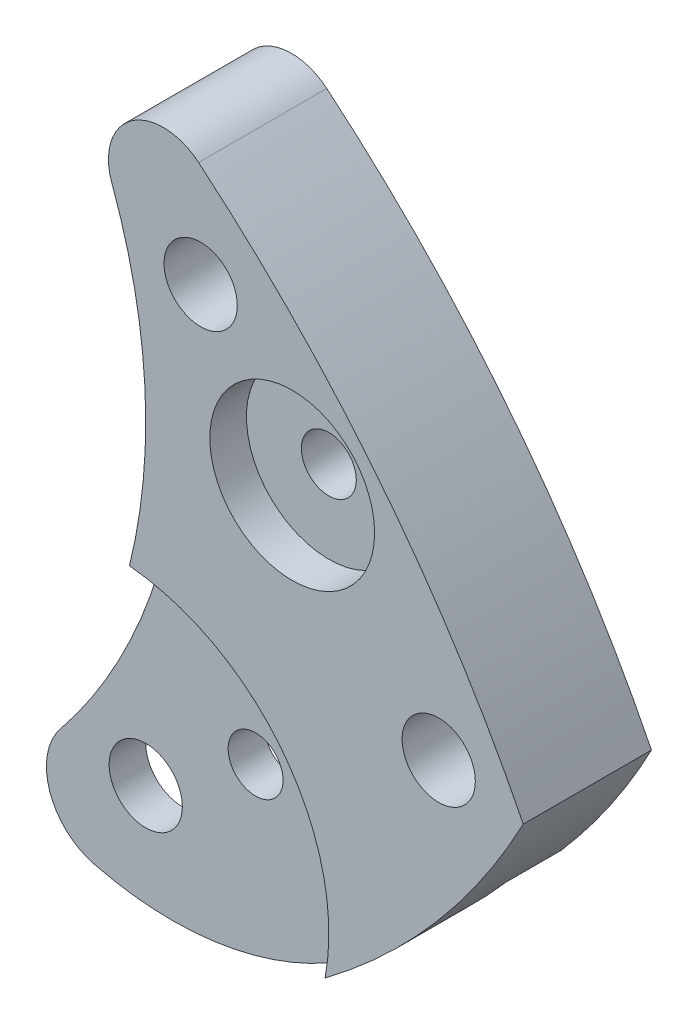
ISO-10303-21;
HEADER;
FILE_DESCRIPTION(('STEP AP214'),'2;1');
FILE_NAME('part.step','',(''),(''),'','','');
FILE_SCHEMA(('AUTOMOTIVE_DESIGN { 1 0 10303 214 1 1 1 1 }'));
ENDSEC;
DATA;
#1=APPLICATION_CONTEXT('core data for automotive mechanical design processes');
#2=APPLICATION_PROTOCOL_DEFINITION('international standard','automotive_design',2000,#1);
#3=PRODUCT_CONTEXT('',#1,'mechanical');
#4=PRODUCT('Part','Part','',(#3));
#5=PRODUCT_RELATED_PRODUCT_CATEGORY('part','',(#4));
#6=PRODUCT_DEFINITION_FORMATION('','',#4);
#7=PRODUCT_DEFINITION_CONTEXT('part definition',#1,'design');
#8=PRODUCT_DEFINITION('design','',#6,#7);
#9=PRODUCT_DEFINITION_SHAPE('','',#8);
#10=(LENGTH_UNIT() NAMED_UNIT(*) SI_UNIT(.MILLI.,.METRE.));
#11=(NAMED_UNIT(*) PLANE_ANGLE_UNIT() SI_UNIT($,.RADIAN.));
#12=(NAMED_UNIT(*) SI_UNIT($,.STERADIAN.) SOLID_ANGLE_UNIT());
#13=UNCERTAINTY_MEASURE_WITH_UNIT(LENGTH_MEASURE(1.E-05),#10,'distance_accuracy_value','');
#14=(GEOMETRIC_REPRESENTATION_CONTEXT(3) GLOBAL_UNCERTAINTY_ASSIGNED_CONTEXT((#13)) GLOBAL_UNIT_ASSIGNED_CONTEXT((#10,
#11,#12)) REPRESENTATION_CONTEXT('',''));
#15=CARTESIAN_POINT('',(0.,0.,0.));
#16=DIRECTION('',(0.,0.,1.));
#17=DIRECTION('',(1.,0.,0.));
#18=AXIS2_PLACEMENT_3D('',#15,#16,#17);
#19=CARTESIAN_POINT('',(9.5,4.75,1.75));
#20=DIRECTION('',(0.,0.,-1.));
#21=DIRECTION('',(-1.,0.,0.));
#22=AXIS2_PLACEMENT_3D('',#19,#20,#21);
#23=CYLINDRICAL_SURFACE('',#22,0.855387483534203);
#24=CARTESIAN_POINT('',(9.5,4.75,1.25));
#25=DIRECTION('',(0.,0.,1.));
#26=DIRECTION('',(1.,0.,0.));
#27=AXIS2_PLACEMENT_3D('',#24,#25,#26);
#28=CIRCLE('',#27,0.855387483534203);
#29=CARTESIAN_POINT('',(8.83455885152791,5.28747169684284,1.25));
#30=VERTEX_POINT('',#29);
#31=CARTESIAN_POINT('',(9.28763002381973,3.92139470180057,1.25));
#32=VERTEX_POINT('',#31);
#33=EDGE_CURVE('E267',#30,#32,#28,.T.);
#34=ORIENTED_EDGE('',*,*,#33,.F.);
#35=DIRECTION('',(0.,0.,-1.));
#36=VECTOR('',#35,1.);
#37=CARTESIAN_POINT('',(8.83455885152791,5.28747169684284,1.75));
#38=LINE('',#37,#36);
#39=CARTESIAN_POINT('',(8.83455885152791,5.28747169684284,0.75));
#40=VERTEX_POINT('',#39);
#41=EDGE_CURVE('E168',#30,#40,#38,.T.);
#42=ORIENTED_EDGE('',*,*,#41,.T.);
#43=CARTESIAN_POINT('',(9.5,4.75,0.75));
#44=DIRECTION('',(0.,0.,-1.));
#45=DIRECTION('',(-1.,0.,0.));
#46=AXIS2_PLACEMENT_3D('',#43,#44,#45);
#47=CIRCLE('',#46,0.855387483534203);
#48=CARTESIAN_POINT('',(9.28763002381973,3.92139470180057,0.75));
#49=VERTEX_POINT('',#48);
#50=EDGE_CURVE('E191',#49,#40,#47,.T.);
#51=ORIENTED_EDGE('',*,*,#50,.F.);
#52=DIRECTION('',(0.,0.,-1.));
#53=VECTOR('',#52,1.);
#54=CARTESIAN_POINT('',(9.28763002381973,3.92139470180057,1.75));
#55=LINE('',#54,#53);
#56=EDGE_CURVE('E166',#32,#49,#55,.T.);
#57=ORIENTED_EDGE('',*,*,#56,.F.);
#58=EDGE_LOOP('',(#34,#42,#51,#57));
#59=FACE_BOUND('',#58,.T.);
#60=ADVANCED_FACE('F38',(#59),#23,.T.);
#61=CARTESIAN_POINT('',(10.3593783598883,8.10304205881201,1.75));
#62=DIRECTION('',(0.,0.,-1.));
#63=DIRECTION('',(-1.,0.,0.));
#64=AXIS2_PLACEMENT_3D('',#61,#62,#63);
#65=CYLINDRICAL_SURFACE('',#64,4.31680658754437);
#66=CARTESIAN_POINT('',(10.3593783598883,8.10304205881201,1.25));
#67=DIRECTION('',(0.,0.,1.));
#68=DIRECTION('',(1.,0.,0.));
#69=AXIS2_PLACEMENT_3D('',#66,#67,#68);
#70=CIRCLE('',#69,4.31680658754437);
#71=CARTESIAN_POINT('',(12.9490145009742,4.64926097555729,1.25));
#72=VERTEX_POINT('',#71);
#73=EDGE_CURVE('E266',#32,#72,#70,.T.);
#74=ORIENTED_EDGE('',*,*,#73,.F.);
#75=ORIENTED_EDGE('',*,*,#56,.T.);
#76=CARTESIAN_POINT('',(10.3593783598883,8.10304205881201,0.75));
#77=DIRECTION('',(0.,0.,-1.));
#78=DIRECTION('',(-1.,0.,0.));
#79=AXIS2_PLACEMENT_3D('',#76,#77,#78);
#80=CIRCLE('',#79,4.31680658754437);
#81=CARTESIAN_POINT('',(12.9490145009742,4.64926097555729,0.75));
#82=VERTEX_POINT('',#81);
#83=EDGE_CURVE('E177',#82,#49,#80,.T.);
#84=ORIENTED_EDGE('',*,*,#83,.F.);
#85=DIRECTION('',(0.,0.,-1.));
#86=VECTOR('',#85,1.);
#87=CARTESIAN_POINT('',(12.9490145009742,4.64926097555729,1.75));
#88=LINE('',#87,#86);
#89=EDGE_CURVE('E164',#72,#82,#88,.T.);
#90=ORIENTED_EDGE('',*,*,#89,.F.);
#91=EDGE_LOOP('',(#74,#75,#84,#90));
#92=FACE_BOUND('',#91,.T.);
#93=ADVANCED_FACE('F228',(#92),#65,.T.);
#94=CARTESIAN_POINT('',(10.,5.2,1.75));
#95=DIRECTION('',(0.,0.,-1.));
#96=DIRECTION('',(-1.,0.,0.));
#97=AXIS2_PLACEMENT_3D('',#94,#95,#96);
#98=CYLINDRICAL_SURFACE('',#97,0.500000000000001);
#99=CARTESIAN_POINT('',(10.,5.2,0.75));
#100=DIRECTION('',(0.,0.,-1.));
#101=DIRECTION('',(-1.,0.,0.));
#102=AXIS2_PLACEMENT_3D('',#99,#100,#101);
#103=CIRCLE('',#102,0.500000000000001);
#104=CARTESIAN_POINT('',(9.5,5.2,0.75));
#105=VERTEX_POINT('',#104);
#106=EDGE_CURVE('E170',#105,#105,#103,.T.);
#107=ORIENTED_EDGE('',*,*,#106,.T.);
#108=EDGE_LOOP('',(#107));
#109=FACE_BOUND('',#108,.T.);
#110=CARTESIAN_POINT('',(10.,5.2,1.25));
#111=DIRECTION('',(0.,0.,1.));
#112=DIRECTION('',(1.,0.,0.));
#113=AXIS2_PLACEMENT_3D('',#110,#111,#112);
#114=CIRCLE('',#113,0.500000000000001);
#115=CARTESIAN_POINT('',(10.5,5.2,1.25));
#116=VERTEX_POINT('',#115);
#117=EDGE_CURVE('E334',#116,#116,#114,.T.);
#118=ORIENTED_EDGE('',*,*,#117,.T.);
#119=EDGE_LOOP('',(#118));
#120=FACE_BOUND('',#119,.T.);
#121=ADVANCED_FACE('F234',(#109,#120),#98,.F.);
#122=CARTESIAN_POINT('',(3.,10.,1.75));
#123=DIRECTION('',(0.,0.,-1.));
#124=DIRECTION('',(-1.,0.,0.));
#125=AXIS2_PLACEMENT_3D('',#122,#123,#124);
#126=CYLINDRICAL_SURFACE('',#125,7.5);
#127=CARTESIAN_POINT('',(3.,10.,1.25));
#128=DIRECTION('',(0.,0.,1.));
#129=DIRECTION('',(1.,0.,0.));
#130=AXIS2_PLACEMENT_3D('',#127,#128,#129);
#131=CIRCLE('',#130,7.5);
#132=CARTESIAN_POINT('',(10.2776024250335,8.18712853650718,1.25));
#133=VERTEX_POINT('',#132);
#134=EDGE_CURVE('E134',#133,#30,#131,.F.);
#135=ORIENTED_EDGE('',*,*,#134,.F.);
#136=DIRECTION('',(0.,0.,1.));
#137=VECTOR('',#136,1.);
#138=CARTESIAN_POINT('',(10.2776024250335,8.18712853650718,1.5));
#139=LINE('',#138,#137);
#140=CARTESIAN_POINT('',(10.2776024250335,8.18712853650718,1.75));
#141=VERTEX_POINT('',#140);
#142=EDGE_CURVE('E119',#133,#141,#139,.T.);
#143=ORIENTED_EDGE('',*,*,#142,.T.);
#144=CARTESIAN_POINT('',(3.,10.,1.75));
#145=DIRECTION('',(0.,0.,-1.));
#146=DIRECTION('',(1.,0.,0.));
#147=AXIS2_PLACEMENT_3D('',#144,#145,#146);
#148=CIRCLE('',#147,7.5);
#149=CARTESIAN_POINT('',(10.0373731864196,12.5933334986196,1.75));
#150=VERTEX_POINT('',#149);
#151=EDGE_CURVE('E131',#150,#141,#148,.T.);
#152=ORIENTED_EDGE('',*,*,#151,.F.);
#153=DIRECTION('',(0.,0.,-1.));
#154=VECTOR('',#153,1.);
#155=CARTESIAN_POINT('',(10.0373731864196,12.5933334986196,1.75));
#156=LINE('',#155,#154);
#157=CARTESIAN_POINT('',(10.0373731864196,12.5933334986196,0.75));
#158=VERTEX_POINT('',#157);
#159=EDGE_CURVE('E46',#150,#158,#156,.T.);
#160=ORIENTED_EDGE('',*,*,#159,.T.);
#161=CARTESIAN_POINT('',(3.,10.,0.75));
#162=DIRECTION('',(0.,0.,-1.));
#163=DIRECTION('',(-1.,0.,0.));
#164=AXIS2_PLACEMENT_3D('',#161,#162,#163);
#165=CIRCLE('',#164,7.5);
#166=EDGE_CURVE('E194',#40,#158,#165,.F.);
#167=ORIENTED_EDGE('',*,*,#166,.F.);
#168=ORIENTED_EDGE('',*,*,#41,.F.);
#169=EDGE_LOOP('',(#135,#143,#152,#160,#167,#168));
#170=FACE_BOUND('',#169,.T.);
#171=ADVANCED_FACE('F129',(#170),#126,.F.);
#172=CARTESIAN_POINT('',(5.37055525253078,6.42633342424077,1.75));
#173=DIRECTION('',(0.,0.,-1.));
#174=DIRECTION('',(-1.,0.,0.));
#175=AXIS2_PLACEMENT_3D('',#172,#173,#174);
#176=PLANE('',#175);
#177=CARTESIAN_POINT('',(12.5,10.25,1.75));
#178=DIRECTION('',(0.,0.,1.));
#179=DIRECTION('',(1.,0.,0.));
#180=AXIS2_PLACEMENT_3D('',#177,#178,#179);
#181=CIRCLE('',#180,1.125);
#182=CARTESIAN_POINT('',(13.625,10.25,1.75));
#183=VERTEX_POINT('',#182);
#184=EDGE_CURVE('E278',#183,#183,#181,.T.);
#185=ORIENTED_EDGE('',*,*,#184,.F.);
#186=EDGE_LOOP('',(#185));
#187=FACE_BOUND('',#186,.T.);
#188=CARTESIAN_POINT('',(11.25,12.,1.75));
#189=DIRECTION('',(0.,0.,1.));
#190=DIRECTION('',(1.,0.,0.));
#191=AXIS2_PLACEMENT_3D('',#188,#189,#190);
#192=CIRCLE('',#191,0.500000000000001);
#193=CARTESIAN_POINT('',(11.75,12.,1.75));
#194=VERTEX_POINT('',#193);
#195=EDGE_CURVE('E156',#194,#194,#192,.T.);
#196=ORIENTED_EDGE('',*,*,#195,.F.);
#197=EDGE_LOOP('',(#196));
#198=FACE_BOUND('',#197,.T.);
#199=ORIENTED_EDGE('',*,*,#151,.T.);
#200=CARTESIAN_POINT('',(10.,5.2,1.75));
#201=DIRECTION('',(0.,0.,1.));
#202=DIRECTION('',(1.,0.,0.));
#203=AXIS2_PLACEMENT_3D('',#200,#201,#202);
#204=CIRCLE('',#203,3.);
#205=CARTESIAN_POINT('',(12.9490145009742,4.64926097555729,1.75));
#206=VERTEX_POINT('',#205);
#207=EDGE_CURVE('E116',#206,#141,#204,.T.);
#208=ORIENTED_EDGE('',*,*,#207,.F.);
#209=CARTESIAN_POINT('',(7.25,12.25,1.75));
#210=DIRECTION('',(0.,0.,1.));
#211=DIRECTION('',(1.,0.,0.));
#212=AXIS2_PLACEMENT_3D('',#209,#210,#211);
#213=CIRCLE('',#212,9.5);
#214=CARTESIAN_POINT('',(15.6547566555464,7.82167463243173,1.75));
#215=VERTEX_POINT('',#214);
#216=EDGE_CURVE('E142',#206,#215,#213,.T.);
#217=ORIENTED_EDGE('',*,*,#216,.T.);
#218=CARTESIAN_POINT('',(0.,0.,1.75));
#219=DIRECTION('',(0.,0.,1.));
#220=DIRECTION('',(1.,0.,0.));
#221=AXIS2_PLACEMENT_3D('',#218,#219,#220);
#222=CIRCLE('',#221,17.5);
#223=CARTESIAN_POINT('',(11.2220557515568,13.4281593939359,1.75));
#224=VERTEX_POINT('',#223);
#225=EDGE_CURVE('E144',#215,#224,#222,.T.);
#226=ORIENTED_EDGE('',*,*,#225,.T.);
#227=CARTESIAN_POINT('',(10.7411105050616,12.8526668484815,1.75));
#228=DIRECTION('',(0.,0.,1.));
#229=DIRECTION('',(-1.,0.,0.));
#230=AXIS2_PLACEMENT_3D('',#227,#228,#229);
#231=CIRCLE('',#230,0.749999999999996);
#232=EDGE_CURVE('E140',#224,#150,#231,.T.);
#233=ORIENTED_EDGE('',*,*,#232,.T.);
#234=EDGE_LOOP('',(#199,#208,#217,#226,#233));
#235=FACE_BOUND('',#234,.T.);
#236=CARTESIAN_POINT('',(14.5,8.,1.75));
#237=DIRECTION('',(0.,0.,1.));
#238=DIRECTION('',(1.,0.,0.));
#239=AXIS2_PLACEMENT_3D('',#236,#237,#238);
#240=CIRCLE('',#239,0.500000000000001);
#241=CARTESIAN_POINT('',(15.,8.,1.75));
#242=VERTEX_POINT('',#241);
#243=EDGE_CURVE('E197',#242,#242,#240,.T.);
#244=ORIENTED_EDGE('',*,*,#243,.F.);
#245=EDGE_LOOP('',(#244));
#246=FACE_BOUND('',#245,.T.);
#247=ADVANCED_FACE('F137',(#187,#198,#235,#246),#176,.F.);
#248=CARTESIAN_POINT('',(5.37055525253078,6.42633342424077,0.));
#249=DIRECTION('',(0.,0.,-1.));
#250=DIRECTION('',(-1.,0.,0.));
#251=AXIS2_PLACEMENT_3D('',#248,#249,#250);
#252=PLANE('',#251);
#253=CARTESIAN_POINT('',(12.5,10.25,0.));
#254=DIRECTION('',(0.,0.,1.));
#255=DIRECTION('',(1.,0.,0.));
#256=AXIS2_PLACEMENT_3D('',#253,#254,#255);
#257=CIRCLE('',#256,0.375);
#258=CARTESIAN_POINT('',(12.875,10.25,0.));
#259=VERTEX_POINT('',#258);
#260=EDGE_CURVE('E343',#259,#259,#257,.T.);
#261=ORIENTED_EDGE('',*,*,#260,.T.);
#262=EDGE_LOOP('',(#261));
#263=FACE_BOUND('',#262,.T.);
#264=CARTESIAN_POINT('',(3.,10.,0.));
#265=DIRECTION('',(0.,0.,-1.));
#266=DIRECTION('',(-1.,0.,0.));
#267=AXIS2_PLACEMENT_3D('',#264,#265,#266);
#268=CIRCLE('',#267,7.75);
#269=CARTESIAN_POINT('',(10.0669489653081,13.1813098437169,0.));
#270=VERTEX_POINT('',#269);
#271=CARTESIAN_POINT('',(10.7415632528567,9.63847766041607,0.));
#272=VERTEX_POINT('',#271);
#273=EDGE_CURVE('E280',#270,#272,#268,.T.);
#274=ORIENTED_EDGE('',*,*,#273,.F.);
#275=CARTESIAN_POINT('',(10.7411105050616,12.8526668484815,0.));
#276=DIRECTION('',(0.,0.,1.));
#277=DIRECTION('',(-1.,0.,0.));
#278=AXIS2_PLACEMENT_3D('',#275,#276,#277);
#279=CIRCLE('',#278,0.749999999999996);
#280=CARTESIAN_POINT('',(11.2220557515568,13.4281593939359,0.));
#281=VERTEX_POINT('',#280);
#282=EDGE_CURVE('E152',#281,#270,#279,.T.);
#283=ORIENTED_EDGE('',*,*,#282,.F.);
#284=CARTESIAN_POINT('',(0.,0.,0.));
#285=DIRECTION('',(0.,0.,1.));
#286=DIRECTION('',(1.,0.,0.));
#287=AXIS2_PLACEMENT_3D('',#284,#285,#286);
#288=CIRCLE('',#287,17.5);
#289=CARTESIAN_POINT('',(15.6547566555464,7.82167463243173,0.));
#290=VERTEX_POINT('',#289);
#291=EDGE_CURVE('E146',#290,#281,#288,.T.);
#292=ORIENTED_EDGE('',*,*,#291,.F.);
#293=CARTESIAN_POINT('',(7.25,12.25,0.));
#294=DIRECTION('',(0.,0.,1.));
#295=DIRECTION('',(1.,0.,0.));
#296=AXIS2_PLACEMENT_3D('',#293,#294,#295);
#297=CIRCLE('',#296,9.5);
#298=CARTESIAN_POINT('',(14.42418408232,6.02255407466384,0.));
#299=VERTEX_POINT('',#298);
#300=EDGE_CURVE('E155',#299,#290,#297,.T.);
#301=ORIENTED_EDGE('',*,*,#300,.F.);
#302=CARTESIAN_POINT('',(10.,5.2,0.));
#303=DIRECTION('',(0.,0.,-1.));
#304=DIRECTION('',(-1.,0.,0.));
#305=AXIS2_PLACEMENT_3D('',#302,#303,#304);
#306=CIRCLE('',#305,4.5);
#307=EDGE_CURVE('E179',#272,#299,#306,.T.);
#308=ORIENTED_EDGE('',*,*,#307,.F.);
#309=EDGE_LOOP('',(#274,#283,#292,#301,#308));
#310=FACE_BOUND('',#309,.T.);
#311=CARTESIAN_POINT('',(11.25,12.,0.));
#312=DIRECTION('',(0.,0.,1.));
#313=DIRECTION('',(1.,0.,0.));
#314=AXIS2_PLACEMENT_3D('',#311,#312,#313);
#315=CIRCLE('',#314,0.500000000000001);
#316=CARTESIAN_POINT('',(11.75,12.,0.));
#317=VERTEX_POINT('',#316);
#318=EDGE_CURVE('E200',#317,#317,#315,.T.);
#319=ORIENTED_EDGE('',*,*,#318,.T.);
#320=EDGE_LOOP('',(#319));
#321=FACE_BOUND('',#320,.T.);
#322=CARTESIAN_POINT('',(14.5,8.,0.));
#323=DIRECTION('',(0.,0.,1.));
#324=DIRECTION('',(1.,0.,0.));
#325=AXIS2_PLACEMENT_3D('',#322,#323,#324);
#326=CIRCLE('',#325,0.500000000000001);
#327=CARTESIAN_POINT('',(15.,8.,0.));
#328=VERTEX_POINT('',#327);
#329=EDGE_CURVE('E196',#328,#328,#326,.T.);
#330=ORIENTED_EDGE('',*,*,#329,.T.);
#331=EDGE_LOOP('',(#330));
#332=FACE_BOUND('',#331,.T.);
#333=ADVANCED_FACE('F207',(#263,#310,#321,#332),#252,.T.);
#334=CARTESIAN_POINT('',(10.7411105050616,12.8526668484815,1.75));
#335=DIRECTION('',(0.,0.,-1.));
#336=DIRECTION('',(-1.,0.,0.));
#337=AXIS2_PLACEMENT_3D('',#334,#335,#336);
#338=CYLINDRICAL_SURFACE('',#337,0.749999999999996);
#339=ORIENTED_EDGE('',*,*,#282,.T.);
#340=DIRECTION('',(0.,0.,-1.));
#341=VECTOR('',#340,1.);
#342=CARTESIAN_POINT('',(10.0669489653081,13.1813098437169,4.37319929683151));
#343=LINE('',#342,#341);
#344=CARTESIAN_POINT('',(10.0669489653081,13.1813098437169,0.75));
#345=VERTEX_POINT('',#344);
#346=EDGE_CURVE('E272',#345,#270,#343,.T.);
#347=ORIENTED_EDGE('',*,*,#346,.F.);
#348=CARTESIAN_POINT('',(10.7411105050616,12.8526668484815,0.75));
#349=DIRECTION('',(0.,0.,-1.));
#350=DIRECTION('',(-1.,0.,0.));
#351=AXIS2_PLACEMENT_3D('',#348,#349,#350);
#352=CIRCLE('',#351,0.749999999999997);
#353=EDGE_CURVE('E184',#345,#158,#352,.F.);
#354=ORIENTED_EDGE('',*,*,#353,.T.);
#355=ORIENTED_EDGE('',*,*,#159,.F.);
#356=ORIENTED_EDGE('',*,*,#232,.F.);
#357=DIRECTION('',(0.,0.,-1.));
#358=VECTOR('',#357,1.);
#359=CARTESIAN_POINT('',(11.2220557515568,13.4281593939359,1.75));
#360=LINE('',#359,#358);
#361=EDGE_CURVE('E151',#224,#281,#360,.T.);
#362=ORIENTED_EDGE('',*,*,#361,.T.);
#363=EDGE_LOOP('',(#339,#347,#354,#355,#356,#362));
#364=FACE_BOUND('',#363,.T.);
#365=ADVANCED_FACE('F40',(#364),#338,.T.);
#366=CARTESIAN_POINT('',(7.25,12.25,1.75));
#367=DIRECTION('',(0.,0.,-1.));
#368=DIRECTION('',(-1.,0.,0.));
#369=AXIS2_PLACEMENT_3D('',#366,#367,#368);
#370=CYLINDRICAL_SURFACE('',#369,9.5);
#371=CARTESIAN_POINT('',(7.25,12.25,0.75));
#372=DIRECTION('',(0.,0.,-1.));
#373=DIRECTION('',(-1.,0.,0.));
#374=AXIS2_PLACEMENT_3D('',#371,#372,#373);
#375=CIRCLE('',#374,9.5);
#376=CARTESIAN_POINT('',(14.42418408232,6.02255407466384,0.75));
#377=VERTEX_POINT('',#376);
#378=EDGE_CURVE('E172',#377,#82,#375,.T.);
#379=ORIENTED_EDGE('',*,*,#378,.F.);
#380=DIRECTION('',(0.,0.,-1.));
#381=VECTOR('',#380,1.);
#382=CARTESIAN_POINT('',(14.42418408232,6.02255407466384,0.375));
#383=LINE('',#382,#381);
#384=EDGE_CURVE('E11',#377,#299,#383,.T.);
#385=ORIENTED_EDGE('',*,*,#384,.T.);
#386=ORIENTED_EDGE('',*,*,#300,.T.);
#387=DIRECTION('',(0.,0.,-1.));
#388=VECTOR('',#387,1.);
#389=CARTESIAN_POINT('',(15.6547566555464,7.82167463243173,1.75));
#390=LINE('',#389,#388);
#391=EDGE_CURVE('E161',#215,#290,#390,.T.);
#392=ORIENTED_EDGE('',*,*,#391,.F.);
#393=ORIENTED_EDGE('',*,*,#216,.F.);
#394=EDGE_CURVE('E121',#206,#72,#88,.T.);
#395=ORIENTED_EDGE('',*,*,#394,.T.);
#396=ORIENTED_EDGE('',*,*,#89,.T.);
#397=EDGE_LOOP('',(#379,#385,#386,#392,#393,#395,#396));
#398=FACE_BOUND('',#397,.T.);
#399=ADVANCED_FACE('F223',(#398),#370,.T.);
#400=CARTESIAN_POINT('',(0.,0.,1.75));
#401=DIRECTION('',(0.,0.,-1.));
#402=DIRECTION('',(-1.,0.,0.));
#403=AXIS2_PLACEMENT_3D('',#400,#401,#402);
#404=CYLINDRICAL_SURFACE('',#403,17.5);
#405=ORIENTED_EDGE('',*,*,#291,.T.);
#406=ORIENTED_EDGE('',*,*,#361,.F.);
#407=ORIENTED_EDGE('',*,*,#225,.F.);
#408=ORIENTED_EDGE('',*,*,#391,.T.);
#409=EDGE_LOOP('',(#405,#406,#407,#408));
#410=FACE_BOUND('',#409,.T.);
#411=ADVANCED_FACE('F213',(#410),#404,.T.);
#412=CARTESIAN_POINT('',(11.25,12.,1.75));
#413=DIRECTION('',(0.,0.,-1.));
#414=DIRECTION('',(-1.,0.,0.));
#415=AXIS2_PLACEMENT_3D('',#412,#413,#414);
#416=CYLINDRICAL_SURFACE('',#415,0.500000000000001);
#417=ORIENTED_EDGE('',*,*,#195,.T.);
#418=EDGE_LOOP('',(#417));
#419=FACE_BOUND('',#418,.T.);
#420=ORIENTED_EDGE('',*,*,#318,.F.);
#421=EDGE_LOOP('',(#420));
#422=FACE_BOUND('',#421,.T.);
#423=ADVANCED_FACE('F210',(#419,#422),#416,.F.);
#424=CARTESIAN_POINT('',(14.5,8.,1.75));
#425=DIRECTION('',(0.,0.,-1.));
#426=DIRECTION('',(-1.,0.,0.));
#427=AXIS2_PLACEMENT_3D('',#424,#425,#426);
#428=CYLINDRICAL_SURFACE('',#427,0.500000000000001);
#429=ORIENTED_EDGE('',*,*,#243,.T.);
#430=EDGE_LOOP('',(#429));
#431=FACE_BOUND('',#430,.T.);
#432=ORIENTED_EDGE('',*,*,#329,.F.);
#433=EDGE_LOOP('',(#432));
#434=FACE_BOUND('',#433,.T.);
#435=ADVANCED_FACE('F212',(#431,#434),#428,.F.);
#436=CARTESIAN_POINT('',(10.,5.2,0.75));
#437=DIRECTION('',(0.,0.,-1.));
#438=DIRECTION('',(-1.,0.,0.));
#439=AXIS2_PLACEMENT_3D('',#436,#437,#438);
#440=CYLINDRICAL_SURFACE('',#439,4.5);
#441=CARTESIAN_POINT('',(10.,5.2,0.75));
#442=DIRECTION('',(0.,0.,-1.));
#443=DIRECTION('',(-1.,0.,0.));
#444=AXIS2_PLACEMENT_3D('',#441,#442,#443);
#445=CIRCLE('',#444,4.5);
#446=CARTESIAN_POINT('',(10.7415632528567,9.63847766041607,0.75));
#447=VERTEX_POINT('',#446);
#448=EDGE_CURVE('E173',#447,#377,#445,.T.);
#449=ORIENTED_EDGE('',*,*,#448,.F.);
#450=DIRECTION('',(0.,0.,-1.));
#451=VECTOR('',#450,1.);
#452=CARTESIAN_POINT('',(10.7415632528567,9.63847766041607,4.37319929683151));
#453=LINE('',#452,#451);
#454=EDGE_CURVE('E61',#447,#272,#453,.T.);
#455=ORIENTED_EDGE('',*,*,#454,.T.);
#456=ORIENTED_EDGE('',*,*,#307,.T.);
#457=ORIENTED_EDGE('',*,*,#384,.F.);
#458=EDGE_LOOP('',(#449,#455,#456,#457));
#459=FACE_BOUND('',#458,.T.);
#460=ADVANCED_FACE('F220',(#459),#440,.F.);
#461=CARTESIAN_POINT('',(10.,5.2,0.75));
#462=DIRECTION('',(0.,0.,-1.));
#463=DIRECTION('',(-1.,0.,0.));
#464=AXIS2_PLACEMENT_3D('',#461,#462,#463);
#465=PLANE('',#464);
#466=CARTESIAN_POINT('',(11.5,6.2,0.75));
#467=DIRECTION('',(0.,0.,-1.));
#468=DIRECTION('',(-1.,0.,0.));
#469=AXIS2_PLACEMENT_3D('',#466,#467,#468);
#470=CIRCLE('',#469,0.374999999999989);
#471=CARTESIAN_POINT('',(11.125,6.2,0.75));
#472=VERTEX_POINT('',#471);
#473=EDGE_CURVE('E125',#472,#472,#470,.T.);
#474=ORIENTED_EDGE('',*,*,#473,.F.);
#475=EDGE_LOOP('',(#474));
#476=FACE_BOUND('',#475,.T.);
#477=ORIENTED_EDGE('',*,*,#106,.F.);
#478=EDGE_LOOP('',(#477));
#479=FACE_BOUND('',#478,.T.);
#480=ORIENTED_EDGE('',*,*,#166,.T.);
#481=ORIENTED_EDGE('',*,*,#353,.F.);
#482=CARTESIAN_POINT('',(3.,10.,0.75));
#483=DIRECTION('',(0.,0.,-1.));
#484=DIRECTION('',(-1.,0.,0.));
#485=AXIS2_PLACEMENT_3D('',#482,#483,#484);
#486=CIRCLE('',#485,7.75);
#487=EDGE_CURVE('E273',#447,#345,#486,.F.);
#488=ORIENTED_EDGE('',*,*,#487,.F.);
#489=ORIENTED_EDGE('',*,*,#448,.T.);
#490=ORIENTED_EDGE('',*,*,#378,.T.);
#491=ORIENTED_EDGE('',*,*,#83,.T.);
#492=ORIENTED_EDGE('',*,*,#50,.T.);
#493=EDGE_LOOP('',(#480,#481,#488,#489,#490,#491,#492));
#494=FACE_BOUND('',#493,.T.);
#495=ADVANCED_FACE('F262',(#476,#479,#494),#465,.T.);
#496=CARTESIAN_POINT('',(3.,10.,4.37319929683151));
#497=DIRECTION('',(0.,0.,-1.));
#498=DIRECTION('',(-1.,0.,0.));
#499=AXIS2_PLACEMENT_3D('',#496,#497,#498);
#500=CYLINDRICAL_SURFACE('',#499,7.75);
#501=ORIENTED_EDGE('',*,*,#487,.T.);
#502=ORIENTED_EDGE('',*,*,#346,.T.);
#503=ORIENTED_EDGE('',*,*,#273,.T.);
#504=ORIENTED_EDGE('',*,*,#454,.F.);
#505=EDGE_LOOP('',(#501,#502,#503,#504));
#506=FACE_BOUND('',#505,.T.);
#507=ADVANCED_FACE('F283',(#506),#500,.F.);
#508=CARTESIAN_POINT('',(12.5,10.25,1.25));
#509=DIRECTION('',(0.,0.,1.));
#510=DIRECTION('',(1.,0.,0.));
#511=AXIS2_PLACEMENT_3D('',#508,#509,#510);
#512=CYLINDRICAL_SURFACE('',#511,1.125);
#513=CARTESIAN_POINT('',(12.5,10.25,1.25));
#514=DIRECTION('',(0.,0.,1.));
#515=DIRECTION('',(1.,0.,0.));
#516=AXIS2_PLACEMENT_3D('',#513,#514,#515);
#517=CIRCLE('',#516,1.125);
#518=CARTESIAN_POINT('',(13.625,10.25,1.25));
#519=VERTEX_POINT('',#518);
#520=EDGE_CURVE('E281',#519,#519,#517,.T.);
#521=ORIENTED_EDGE('',*,*,#520,.F.);
#522=EDGE_LOOP('',(#521));
#523=FACE_BOUND('',#522,.T.);
#524=ORIENTED_EDGE('',*,*,#184,.T.);
#525=EDGE_LOOP('',(#524));
#526=FACE_BOUND('',#525,.T.);
#527=ADVANCED_FACE('F302',(#523,#526),#512,.F.);
#528=CARTESIAN_POINT('',(12.5,10.25,1.25));
#529=DIRECTION('',(0.,0.,1.));
#530=DIRECTION('',(1.,0.,0.));
#531=AXIS2_PLACEMENT_3D('',#528,#529,#530);
#532=PLANE('',#531);
#533=CARTESIAN_POINT('',(12.5,10.25,1.25));
#534=DIRECTION('',(0.,0.,1.));
#535=DIRECTION('',(1.,0.,0.));
#536=AXIS2_PLACEMENT_3D('',#533,#534,#535);
#537=CIRCLE('',#536,0.375);
#538=CARTESIAN_POINT('',(12.875,10.25,1.25));
#539=VERTEX_POINT('',#538);
#540=EDGE_CURVE('E135',#539,#539,#537,.T.);
#541=ORIENTED_EDGE('',*,*,#540,.F.);
#542=EDGE_LOOP('',(#541));
#543=FACE_BOUND('',#542,.T.);
#544=ORIENTED_EDGE('',*,*,#520,.T.);
#545=EDGE_LOOP('',(#544));
#546=FACE_BOUND('',#545,.T.);
#547=ADVANCED_FACE('F305',(#543,#546),#532,.T.);
#548=CARTESIAN_POINT('',(12.5,10.25,1.25));
#549=DIRECTION('',(0.,0.,1.));
#550=DIRECTION('',(1.,0.,0.));
#551=AXIS2_PLACEMENT_3D('',#548,#549,#550);
#552=CYLINDRICAL_SURFACE('',#551,0.375);
#553=ORIENTED_EDGE('',*,*,#260,.F.);
#554=EDGE_LOOP('',(#553));
#555=FACE_BOUND('',#554,.T.);
#556=ORIENTED_EDGE('',*,*,#540,.T.);
#557=EDGE_LOOP('',(#556));
#558=FACE_BOUND('',#557,.T.);
#559=ADVANCED_FACE('F309',(#555,#558),#552,.F.);
#560=CARTESIAN_POINT('',(10.,5.2,1.25));
#561=DIRECTION('',(0.,0.,1.));
#562=DIRECTION('',(1.,0.,0.));
#563=AXIS2_PLACEMENT_3D('',#560,#561,#562);
#564=CYLINDRICAL_SURFACE('',#563,3.);
#565=CARTESIAN_POINT('',(10.,5.2,1.25));
#566=DIRECTION('',(0.,0.,1.));
#567=DIRECTION('',(1.,0.,0.));
#568=AXIS2_PLACEMENT_3D('',#565,#566,#567);
#569=CIRCLE('',#568,3.);
#570=EDGE_CURVE('E53',#72,#133,#569,.T.);
#571=ORIENTED_EDGE('',*,*,#570,.F.);
#572=ORIENTED_EDGE('',*,*,#394,.F.);
#573=ORIENTED_EDGE('',*,*,#207,.T.);
#574=ORIENTED_EDGE('',*,*,#142,.F.);
#575=EDGE_LOOP('',(#571,#572,#573,#574));
#576=FACE_BOUND('',#575,.T.);
#577=ADVANCED_FACE('F118',(#576),#564,.F.);
#578=CARTESIAN_POINT('',(10.,5.2,1.25));
#579=DIRECTION('',(0.,0.,1.));
#580=DIRECTION('',(1.,0.,0.));
#581=AXIS2_PLACEMENT_3D('',#578,#579,#580);
#582=PLANE('',#581);
#583=CARTESIAN_POINT('',(11.5,6.2,1.25));
#584=DIRECTION('',(0.,0.,1.));
#585=DIRECTION('',(1.,0.,0.));
#586=AXIS2_PLACEMENT_3D('',#583,#584,#585);
#587=CIRCLE('',#586,0.37499999999999);
#588=CARTESIAN_POINT('',(11.875,6.2,1.25));
#589=VERTEX_POINT('',#588);
#590=EDGE_CURVE('E330',#589,#589,#587,.T.);
#591=ORIENTED_EDGE('',*,*,#590,.F.);
#592=EDGE_LOOP('',(#591));
#593=FACE_BOUND('',#592,.T.);
#594=ORIENTED_EDGE('',*,*,#117,.F.);
#595=EDGE_LOOP('',(#594));
#596=FACE_BOUND('',#595,.T.);
#597=ORIENTED_EDGE('',*,*,#134,.T.);
#598=ORIENTED_EDGE('',*,*,#33,.T.);
#599=ORIENTED_EDGE('',*,*,#73,.T.);
#600=ORIENTED_EDGE('',*,*,#570,.T.);
#601=EDGE_LOOP('',(#597,#598,#599,#600));
#602=FACE_BOUND('',#601,.T.);
#603=ADVANCED_FACE('F316',(#593,#596,#602),#582,.T.);
#604=CARTESIAN_POINT('',(11.5,6.2,1.25));
#605=DIRECTION('',(0.,0.,1.));
#606=DIRECTION('',(1.,0.,0.));
#607=AXIS2_PLACEMENT_3D('',#604,#605,#606);
#608=CYLINDRICAL_SURFACE('',#607,0.374999999999989);
#609=ORIENTED_EDGE('',*,*,#473,.T.);
#610=EDGE_LOOP('',(#609));
#611=FACE_BOUND('',#610,.T.);
#612=ORIENTED_EDGE('',*,*,#590,.T.);
#613=EDGE_LOOP('',(#612));
#614=FACE_BOUND('',#613,.T.);
#615=ADVANCED_FACE('F319',(#611,#614),#608,.F.);
#616=CLOSED_SHELL('',(#60,#93,#121,#171,#247,#333,#365,#399,#411,#423,#435,#460,#495,#507,#527,
#547,#559,#577,#603,#615));
#617=MANIFOLD_SOLID_BREP('B2',#616);
#618=ADVANCED_BREP_SHAPE_REPRESENTATION('',(#18,#617),#14);
#619=SHAPE_DEFINITION_REPRESENTATION(#9,#618);
ENDSEC;
END-ISO-10303-21;
